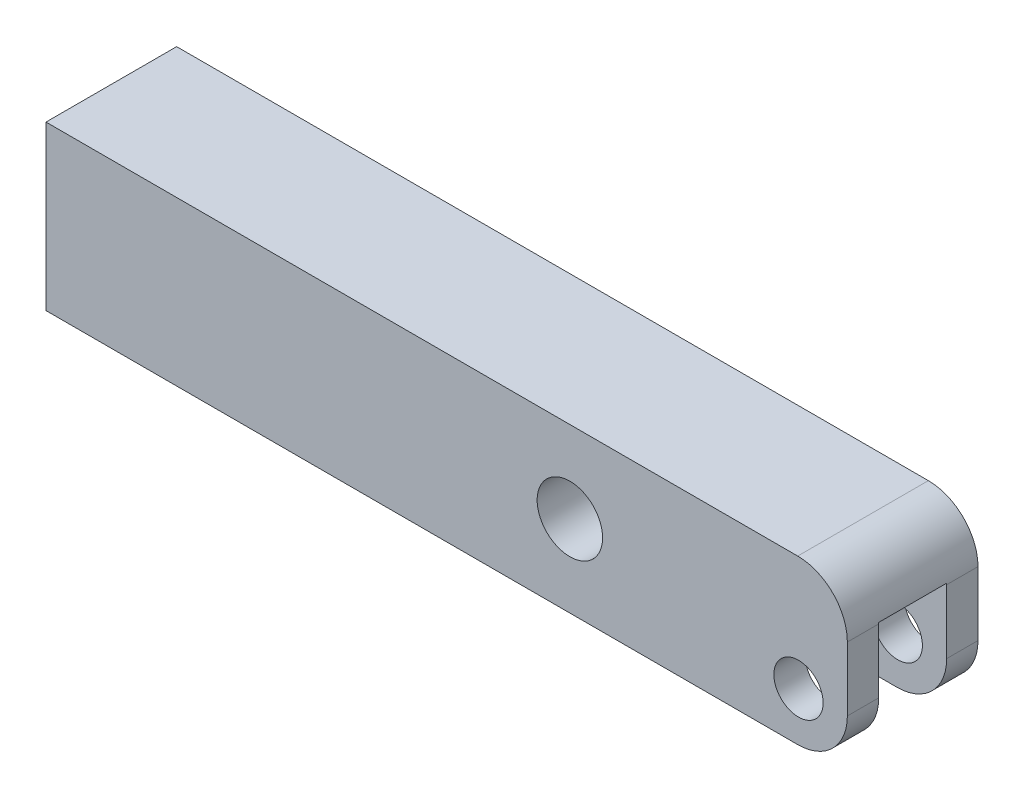
ISO-10303-21;
HEADER;
FILE_DESCRIPTION(('STEP AP214'),'2;1');
FILE_NAME('part.step','',(''),(''),'','','');
FILE_SCHEMA(('AUTOMOTIVE_DESIGN { 1 0 10303 214 1 1 1 1 }'));
ENDSEC;
DATA;
#1=APPLICATION_CONTEXT('core data for automotive mechanical design processes');
#2=APPLICATION_PROTOCOL_DEFINITION('international standard','automotive_design',2000,#1);
#3=PRODUCT_CONTEXT('',#1,'mechanical');
#4=PRODUCT('Part','Part','',(#3));
#5=PRODUCT_RELATED_PRODUCT_CATEGORY('part','',(#4));
#6=PRODUCT_DEFINITION_FORMATION('','',#4);
#7=PRODUCT_DEFINITION_CONTEXT('part definition',#1,'design');
#8=PRODUCT_DEFINITION('design','',#6,#7);
#9=PRODUCT_DEFINITION_SHAPE('','',#8);
#10=(LENGTH_UNIT() NAMED_UNIT(*) SI_UNIT(.MILLI.,.METRE.));
#11=(NAMED_UNIT(*) PLANE_ANGLE_UNIT() SI_UNIT($,.RADIAN.));
#12=(NAMED_UNIT(*) SI_UNIT($,.STERADIAN.) SOLID_ANGLE_UNIT());
#13=UNCERTAINTY_MEASURE_WITH_UNIT(LENGTH_MEASURE(1.E-05),#10,'distance_accuracy_value','');
#14=(GEOMETRIC_REPRESENTATION_CONTEXT(3) GLOBAL_UNCERTAINTY_ASSIGNED_CONTEXT((#13)) GLOBAL_UNIT_ASSIGNED_CONTEXT((#10,
#11,#12)) REPRESENTATION_CONTEXT('',''));
#15=CARTESIAN_POINT('',(0.,0.,0.));
#16=DIRECTION('',(0.,0.,1.));
#17=DIRECTION('',(1.,0.,0.));
#18=AXIS2_PLACEMENT_3D('',#15,#16,#17);
#19=CARTESIAN_POINT('',(4.7498,11.1252,6.35));
#20=DIRECTION('',(-1.,0.,0.));
#21=DIRECTION('',(0.,0.,1.));
#22=AXIS2_PLACEMENT_3D('',#19,#20,#21);
#23=PLANE('',#22);
#24=DIRECTION('',(0.,1.,0.));
#25=VECTOR('',#24,1.);
#26=CARTESIAN_POINT('',(4.7498,11.1252,-6.35));
#27=LINE('',#26,#25);
#28=CARTESIAN_POINT('',(4.7498,0.0762000000000002,-6.35));
#29=VERTEX_POINT('',#28);
#30=CARTESIAN_POINT('',(4.7498,6.2992,-6.35));
#31=VERTEX_POINT('',#30);
#32=EDGE_CURVE('E194',#29,#31,#27,.T.);
#33=ORIENTED_EDGE('',*,*,#32,.T.);
#34=DIRECTION('',(0.,0.,-1.));
#35=VECTOR('',#34,1.);
#36=CARTESIAN_POINT('',(4.7498,6.2992,6.35));
#37=LINE('',#36,#35);
#38=CARTESIAN_POINT('',(4.7498,6.2992,-3.302));
#39=VERTEX_POINT('',#38);
#40=EDGE_CURVE('E222',#31,#39,#37,.F.);
#41=ORIENTED_EDGE('',*,*,#40,.T.);
#42=DIRECTION('',(0.,-1.,0.));
#43=VECTOR('',#42,1.);
#44=CARTESIAN_POINT('',(4.7498,6.4262,-3.302));
#45=LINE('',#44,#43);
#46=CARTESIAN_POINT('',(4.7498,0.0762000000000002,-3.302));
#47=VERTEX_POINT('',#46);
#48=EDGE_CURVE('E133',#39,#47,#45,.T.);
#49=ORIENTED_EDGE('',*,*,#48,.T.);
#50=DIRECTION('',(0.,0.,-1.));
#51=VECTOR('',#50,1.);
#52=CARTESIAN_POINT('',(4.7498,0.0762000000000002,6.35));
#53=LINE('',#52,#51);
#54=EDGE_CURVE('E217',#47,#29,#53,.T.);
#55=ORIENTED_EDGE('',*,*,#54,.T.);
#56=EDGE_LOOP('',(#33,#41,#49,#55));
#57=FACE_BOUND('',#56,.T.);
#58=ADVANCED_FACE('F35',(#57),#23,.F.);
#59=CARTESIAN_POINT('',(0.,0.,6.35));
#60=DIRECTION('',(0.,0.,-1.));
#61=DIRECTION('',(-1.,0.,0.));
#62=AXIS2_PLACEMENT_3D('',#59,#60,#61);
#63=CYLINDRICAL_SURFACE('',#62,2.39395);
#64=CARTESIAN_POINT('',(0.,0.,3.302));
#65=DIRECTION('',(0.,0.,1.));
#66=DIRECTION('',(1.,0.,0.));
#67=AXIS2_PLACEMENT_3D('',#64,#65,#66);
#68=CIRCLE('',#67,2.39395);
#69=CARTESIAN_POINT('',(2.39395,0.,3.302));
#70=VERTEX_POINT('',#69);
#71=EDGE_CURVE('E170',#70,#70,#68,.T.);
#72=ORIENTED_EDGE('',*,*,#71,.F.);
#73=EDGE_LOOP('',(#72));
#74=FACE_BOUND('',#73,.T.);
#75=CARTESIAN_POINT('',(0.,0.,6.35));
#76=DIRECTION('',(0.,0.,1.));
#77=DIRECTION('',(1.,0.,0.));
#78=AXIS2_PLACEMENT_3D('',#75,#76,#77);
#79=CIRCLE('',#78,2.39395);
#80=CARTESIAN_POINT('',(2.39395,0.,6.35));
#81=VERTEX_POINT('',#80);
#82=EDGE_CURVE('E171',#81,#81,#79,.T.);
#83=ORIENTED_EDGE('',*,*,#82,.T.);
#84=EDGE_LOOP('',(#83));
#85=FACE_BOUND('',#84,.T.);
#86=ADVANCED_FACE('F287',(#74,#85),#63,.F.);
#87=CARTESIAN_POINT('',(-73.152,-4.7498,6.35));
#88=DIRECTION('',(0.,0.,1.));
#89=DIRECTION('',(1.,0.,0.));
#90=AXIS2_PLACEMENT_3D('',#87,#88,#89);
#91=PLANE('',#90);
#92=ORIENTED_EDGE('',*,*,#82,.F.);
#93=EDGE_LOOP('',(#92));
#94=FACE_BOUND('',#93,.T.);
#95=DIRECTION('',(0.,1.,0.));
#96=VECTOR('',#95,1.);
#97=CARTESIAN_POINT('',(4.7498,11.1252,6.35));
#98=LINE('',#97,#96);
#99=CARTESIAN_POINT('',(4.7498,0.0762000000000002,6.35));
#100=VERTEX_POINT('',#99);
#101=CARTESIAN_POINT('',(4.7498,6.2992,6.35));
#102=VERTEX_POINT('',#101);
#103=EDGE_CURVE('E183',#100,#102,#98,.T.);
#104=ORIENTED_EDGE('',*,*,#103,.T.);
#105=CARTESIAN_POINT('',(-0.0761999999999985,6.2992,6.35));
#106=DIRECTION('',(0.,0.,1.));
#107=DIRECTION('',(1.,0.,0.));
#108=AXIS2_PLACEMENT_3D('',#105,#106,#107);
#109=CIRCLE('',#108,4.826);
#110=CARTESIAN_POINT('',(-0.0761999999999985,11.1252,6.35));
#111=VERTEX_POINT('',#110);
#112=EDGE_CURVE('E234',#102,#111,#109,.T.);
#113=ORIENTED_EDGE('',*,*,#112,.T.);
#114=DIRECTION('',(-1.,0.,0.));
#115=VECTOR('',#114,1.);
#116=CARTESIAN_POINT('',(-73.152,11.1252,6.35));
#117=LINE('',#116,#115);
#118=CARTESIAN_POINT('',(-73.152,11.1252,6.35));
#119=VERTEX_POINT('',#118);
#120=EDGE_CURVE('E186',#111,#119,#117,.T.);
#121=ORIENTED_EDGE('',*,*,#120,.T.);
#122=DIRECTION('',(0.,-1.,0.));
#123=VECTOR('',#122,1.);
#124=CARTESIAN_POINT('',(-73.152,11.1252,6.35));
#125=LINE('',#124,#123);
#126=CARTESIAN_POINT('',(-73.152,-4.7498,6.35));
#127=VERTEX_POINT('',#126);
#128=EDGE_CURVE('E177',#119,#127,#125,.T.);
#129=ORIENTED_EDGE('',*,*,#128,.T.);
#130=DIRECTION('',(1.,0.,0.));
#131=VECTOR('',#130,1.);
#132=CARTESIAN_POINT('',(-73.152,-4.7498,6.35));
#133=LINE('',#132,#131);
#134=CARTESIAN_POINT('',(-0.0761999999999985,-4.7498,6.35));
#135=VERTEX_POINT('',#134);
#136=EDGE_CURVE('E180',#127,#135,#133,.T.);
#137=ORIENTED_EDGE('',*,*,#136,.T.);
#138=CARTESIAN_POINT('',(-0.0762000000000011,0.0762000000000002,6.35));
#139=DIRECTION('',(0.,0.,1.));
#140=DIRECTION('',(1.,0.,0.));
#141=AXIS2_PLACEMENT_3D('',#138,#139,#140);
#142=CIRCLE('',#141,4.826);
#143=EDGE_CURVE('E232',#135,#100,#142,.T.);
#144=ORIENTED_EDGE('',*,*,#143,.T.);
#145=EDGE_LOOP('',(#104,#113,#121,#129,#137,#144));
#146=FACE_BOUND('',#145,.T.);
#147=CARTESIAN_POINT('',(-22.225,3.175,6.35));
#148=DIRECTION('',(0.,0.,1.));
#149=DIRECTION('',(1.,0.,0.));
#150=AXIS2_PLACEMENT_3D('',#147,#148,#149);
#151=CIRCLE('',#150,3.18135);
#152=CARTESIAN_POINT('',(-19.04365,3.175,6.35));
#153=VERTEX_POINT('',#152);
#154=EDGE_CURVE('E163',#153,#153,#151,.T.);
#155=ORIENTED_EDGE('',*,*,#154,.F.);
#156=EDGE_LOOP('',(#155));
#157=FACE_BOUND('',#156,.T.);
#158=ADVANCED_FACE('F238',(#94,#146,#157),#91,.T.);
#159=CARTESIAN_POINT('',(-73.152,-4.7498,-6.35));
#160=DIRECTION('',(0.,0.,1.));
#161=DIRECTION('',(1.,0.,0.));
#162=AXIS2_PLACEMENT_3D('',#159,#160,#161);
#163=PLANE('',#162);
#164=CARTESIAN_POINT('',(0.,0.,-6.35));
#165=DIRECTION('',(0.,0.,1.));
#166=DIRECTION('',(1.,0.,0.));
#167=AXIS2_PLACEMENT_3D('',#164,#165,#166);
#168=CIRCLE('',#167,2.39395);
#169=CARTESIAN_POINT('',(2.39395,0.,-6.35));
#170=VERTEX_POINT('',#169);
#171=EDGE_CURVE('E166',#170,#170,#168,.T.);
#172=ORIENTED_EDGE('',*,*,#171,.T.);
#173=EDGE_LOOP('',(#172));
#174=FACE_BOUND('',#173,.T.);
#175=DIRECTION('',(-1.,0.,0.));
#176=VECTOR('',#175,1.);
#177=CARTESIAN_POINT('',(-73.152,11.1252,-6.35));
#178=LINE('',#177,#176);
#179=CARTESIAN_POINT('',(-0.0761999999999985,11.1252,-6.35));
#180=VERTEX_POINT('',#179);
#181=CARTESIAN_POINT('',(-73.152,11.1252,-6.35));
#182=VERTEX_POINT('',#181);
#183=EDGE_CURVE('E181',#180,#182,#178,.T.);
#184=ORIENTED_EDGE('',*,*,#183,.F.);
#185=CARTESIAN_POINT('',(-0.0761999999999985,6.2992,-6.35));
#186=DIRECTION('',(0.,0.,1.));
#187=DIRECTION('',(1.,0.,0.));
#188=AXIS2_PLACEMENT_3D('',#185,#186,#187);
#189=CIRCLE('',#188,4.826);
#190=EDGE_CURVE('E212',#180,#31,#189,.F.);
#191=ORIENTED_EDGE('',*,*,#190,.T.);
#192=ORIENTED_EDGE('',*,*,#32,.F.);
#193=CARTESIAN_POINT('',(-0.0762000000000011,0.0762000000000002,-6.35));
#194=DIRECTION('',(0.,0.,1.));
#195=DIRECTION('',(1.,0.,0.));
#196=AXIS2_PLACEMENT_3D('',#193,#194,#195);
#197=CIRCLE('',#196,4.826);
#198=CARTESIAN_POINT('',(-0.0761999999999985,-4.7498,-6.35));
#199=VERTEX_POINT('',#198);
#200=EDGE_CURVE('E210',#29,#199,#197,.F.);
#201=ORIENTED_EDGE('',*,*,#200,.T.);
#202=DIRECTION('',(1.,0.,0.));
#203=VECTOR('',#202,1.);
#204=CARTESIAN_POINT('',(-73.152,-4.7498,-6.35));
#205=LINE('',#204,#203);
#206=CARTESIAN_POINT('',(-73.152,-4.7498,-6.35));
#207=VERTEX_POINT('',#206);
#208=EDGE_CURVE('E191',#207,#199,#205,.T.);
#209=ORIENTED_EDGE('',*,*,#208,.F.);
#210=DIRECTION('',(0.,-1.,0.));
#211=VECTOR('',#210,1.);
#212=CARTESIAN_POINT('',(-73.152,11.1252,-6.35));
#213=LINE('',#212,#211);
#214=EDGE_CURVE('E174',#182,#207,#213,.T.);
#215=ORIENTED_EDGE('',*,*,#214,.F.);
#216=EDGE_LOOP('',(#184,#191,#192,#201,#209,#215));
#217=FACE_BOUND('',#216,.T.);
#218=CARTESIAN_POINT('',(-22.225,3.175,-6.35));
#219=DIRECTION('',(0.,0.,1.));
#220=DIRECTION('',(1.,0.,0.));
#221=AXIS2_PLACEMENT_3D('',#218,#219,#220);
#222=CIRCLE('',#221,3.18135);
#223=CARTESIAN_POINT('',(-19.04365,3.175,-6.35));
#224=VERTEX_POINT('',#223);
#225=EDGE_CURVE('E167',#224,#224,#222,.T.);
#226=ORIENTED_EDGE('',*,*,#225,.T.);
#227=EDGE_LOOP('',(#226));
#228=FACE_BOUND('',#227,.T.);
#229=ADVANCED_FACE('F253',(#174,#217,#228),#163,.F.);
#230=CARTESIAN_POINT('',(-73.152,11.1252,6.35));
#231=DIRECTION('',(1.,0.,0.));
#232=DIRECTION('',(0.,0.,-1.));
#233=AXIS2_PLACEMENT_3D('',#230,#231,#232);
#234=PLANE('',#233);
#235=ORIENTED_EDGE('',*,*,#214,.T.);
#236=DIRECTION('',(0.,0.,-1.));
#237=VECTOR('',#236,1.);
#238=CARTESIAN_POINT('',(-73.152,-4.7498,6.35));
#239=LINE('',#238,#237);
#240=EDGE_CURVE('E200',#127,#207,#239,.T.);
#241=ORIENTED_EDGE('',*,*,#240,.F.);
#242=ORIENTED_EDGE('',*,*,#128,.F.);
#243=DIRECTION('',(0.,0.,-1.));
#244=VECTOR('',#243,1.);
#245=CARTESIAN_POINT('',(-73.152,11.1252,6.35));
#246=LINE('',#245,#244);
#247=EDGE_CURVE('E188',#119,#182,#246,.T.);
#248=ORIENTED_EDGE('',*,*,#247,.T.);
#249=EDGE_LOOP('',(#235,#241,#242,#248));
#250=FACE_BOUND('',#249,.T.);
#251=ADVANCED_FACE('F265',(#250),#234,.F.);
#252=CARTESIAN_POINT('',(-73.152,-4.7498,6.35));
#253=DIRECTION('',(0.,1.,0.));
#254=DIRECTION('',(0.,0.,1.));
#255=AXIS2_PLACEMENT_3D('',#252,#253,#254);
#256=PLANE('',#255);
#257=ORIENTED_EDGE('',*,*,#208,.T.);
#258=DIRECTION('',(0.,0.,-1.));
#259=VECTOR('',#258,1.);
#260=CARTESIAN_POINT('',(-0.0761999999999985,-4.7498,6.35));
#261=LINE('',#260,#259);
#262=CARTESIAN_POINT('',(-0.0762000000000011,-4.7498,-3.302));
#263=VERTEX_POINT('',#262);
#264=EDGE_CURVE('E11',#199,#263,#261,.F.);
#265=ORIENTED_EDGE('',*,*,#264,.T.);
#266=DIRECTION('',(1.,0.,0.));
#267=VECTOR('',#266,1.);
#268=CARTESIAN_POINT('',(-6.4262,-4.7498,-3.302));
#269=LINE('',#268,#267);
#270=CARTESIAN_POINT('',(-6.4262,-4.7498,-3.302));
#271=VERTEX_POINT('',#270);
#272=EDGE_CURVE('E150',#271,#263,#269,.T.);
#273=ORIENTED_EDGE('',*,*,#272,.F.);
#274=CARTESIAN_POINT('',(-6.4262,-4.7498,0.));
#275=DIRECTION('',(0.,-1.,0.));
#276=DIRECTION('',(0.,0.,-1.));
#277=AXIS2_PLACEMENT_3D('',#274,#275,#276);
#278=CIRCLE('',#277,3.302);
#279=CARTESIAN_POINT('',(-6.4262,-4.7498,3.302));
#280=VERTEX_POINT('',#279);
#281=EDGE_CURVE('E129',#280,#271,#278,.T.);
#282=ORIENTED_EDGE('',*,*,#281,.F.);
#283=DIRECTION('',(-1.,0.,0.));
#284=VECTOR('',#283,1.);
#285=CARTESIAN_POINT('',(-6.4262,-4.7498,3.302));
#286=LINE('',#285,#284);
#287=CARTESIAN_POINT('',(-0.0762000000000011,-4.7498,3.302));
#288=VERTEX_POINT('',#287);
#289=EDGE_CURVE('E148',#288,#280,#286,.T.);
#290=ORIENTED_EDGE('',*,*,#289,.F.);
#291=DIRECTION('',(0.,0.,-1.));
#292=VECTOR('',#291,1.);
#293=CARTESIAN_POINT('',(-0.0761999999999985,-4.7498,6.35));
#294=LINE('',#293,#292);
#295=EDGE_CURVE('E43',#288,#135,#294,.F.);
#296=ORIENTED_EDGE('',*,*,#295,.T.);
#297=ORIENTED_EDGE('',*,*,#136,.F.);
#298=ORIENTED_EDGE('',*,*,#240,.T.);
#299=EDGE_LOOP('',(#257,#265,#273,#282,#290,#296,#297,#298));
#300=FACE_BOUND('',#299,.T.);
#301=ADVANCED_FACE('F262',(#300),#256,.F.);
#302=DIRECTION('',(0.,-1.,0.));
#303=VECTOR('',#302,1.);
#304=CARTESIAN_POINT('',(4.7498,6.4262,3.302));
#305=LINE('',#304,#303);
#306=CARTESIAN_POINT('',(4.7498,6.2992,3.302));
#307=VERTEX_POINT('',#306);
#308=CARTESIAN_POINT('',(4.7498,0.0762000000000002,3.302));
#309=VERTEX_POINT('',#308);
#310=EDGE_CURVE('E159',#307,#309,#305,.T.);
#311=ORIENTED_EDGE('',*,*,#310,.F.);
#312=DIRECTION('',(0.,0.,-1.));
#313=VECTOR('',#312,1.);
#314=CARTESIAN_POINT('',(4.7498,6.2992,6.35));
#315=LINE('',#314,#313);
#316=EDGE_CURVE('E220',#307,#102,#315,.F.);
#317=ORIENTED_EDGE('',*,*,#316,.T.);
#318=ORIENTED_EDGE('',*,*,#103,.F.);
#319=DIRECTION('',(0.,0.,-1.));
#320=VECTOR('',#319,1.);
#321=CARTESIAN_POINT('',(4.7498,0.0762000000000002,6.35));
#322=LINE('',#321,#320);
#323=EDGE_CURVE('E214',#100,#309,#322,.T.);
#324=ORIENTED_EDGE('',*,*,#323,.T.);
#325=EDGE_LOOP('',(#311,#317,#318,#324));
#326=FACE_BOUND('',#325,.T.);
#327=ADVANCED_FACE('F271',(#326),#23,.F.);
#328=CARTESIAN_POINT('',(-73.152,11.1252,6.35));
#329=DIRECTION('',(0.,-1.,0.));
#330=DIRECTION('',(0.,0.,-1.));
#331=AXIS2_PLACEMENT_3D('',#328,#329,#330);
#332=PLANE('',#331);
#333=ORIENTED_EDGE('',*,*,#120,.F.);
#334=DIRECTION('',(0.,0.,-1.));
#335=VECTOR('',#334,1.);
#336=CARTESIAN_POINT('',(-0.0761999999999985,11.1252,6.35));
#337=LINE('',#336,#335);
#338=EDGE_CURVE('E203',#111,#180,#337,.T.);
#339=ORIENTED_EDGE('',*,*,#338,.T.);
#340=ORIENTED_EDGE('',*,*,#183,.T.);
#341=ORIENTED_EDGE('',*,*,#247,.F.);
#342=EDGE_LOOP('',(#333,#339,#340,#341));
#343=FACE_BOUND('',#342,.T.);
#344=ADVANCED_FACE('F246',(#343),#332,.F.);
#345=CARTESIAN_POINT('',(0.,0.,-3.302));
#346=DIRECTION('',(0.,0.,-1.));
#347=DIRECTION('',(-1.,0.,0.));
#348=AXIS2_PLACEMENT_3D('',#345,#346,#347);
#349=CIRCLE('',#348,2.39395);
#350=CARTESIAN_POINT('',(-2.39395,0.,-3.302));
#351=VERTEX_POINT('',#350);
#352=EDGE_CURVE('E158',#351,#351,#349,.T.);
#353=ORIENTED_EDGE('',*,*,#352,.F.);
#354=EDGE_LOOP('',(#353));
#355=FACE_BOUND('',#354,.T.);
#356=ORIENTED_EDGE('',*,*,#171,.F.);
#357=EDGE_LOOP('',(#356));
#358=FACE_BOUND('',#357,.T.);
#359=ADVANCED_FACE('F294',(#355,#358),#63,.F.);
#360=CARTESIAN_POINT('',(-22.225,3.175,6.35));
#361=DIRECTION('',(0.,0.,-1.));
#362=DIRECTION('',(-1.,0.,0.));
#363=AXIS2_PLACEMENT_3D('',#360,#361,#362);
#364=CYLINDRICAL_SURFACE('',#363,3.18135);
#365=ORIENTED_EDGE('',*,*,#154,.T.);
#366=EDGE_LOOP('',(#365));
#367=FACE_BOUND('',#366,.T.);
#368=ORIENTED_EDGE('',*,*,#225,.F.);
#369=EDGE_LOOP('',(#368));
#370=FACE_BOUND('',#369,.T.);
#371=ADVANCED_FACE('F283',(#367,#370),#364,.F.);
#372=CARTESIAN_POINT('',(-6.4262,6.4262,0.));
#373=DIRECTION('',(0.,-1.,0.));
#374=DIRECTION('',(0.,0.,-1.));
#375=AXIS2_PLACEMENT_3D('',#372,#373,#374);
#376=CYLINDRICAL_SURFACE('',#375,3.302);
#377=ORIENTED_EDGE('',*,*,#281,.T.);
#378=DIRECTION('',(0.,-1.,0.));
#379=VECTOR('',#378,1.);
#380=CARTESIAN_POINT('',(-6.4262,6.4262,-3.302));
#381=LINE('',#380,#379);
#382=CARTESIAN_POINT('',(-6.4262,6.4262,-3.302));
#383=VERTEX_POINT('',#382);
#384=EDGE_CURVE('E122',#383,#271,#381,.T.);
#385=ORIENTED_EDGE('',*,*,#384,.F.);
#386=CARTESIAN_POINT('',(-6.4262,6.4262,0.));
#387=DIRECTION('',(0.,-1.,0.));
#388=DIRECTION('',(0.,0.,-1.));
#389=AXIS2_PLACEMENT_3D('',#386,#387,#388);
#390=CIRCLE('',#389,3.302);
#391=CARTESIAN_POINT('',(-6.4262,6.4262,3.302));
#392=VERTEX_POINT('',#391);
#393=EDGE_CURVE('E127',#392,#383,#390,.T.);
#394=ORIENTED_EDGE('',*,*,#393,.F.);
#395=DIRECTION('',(0.,-1.,0.));
#396=VECTOR('',#395,1.);
#397=CARTESIAN_POINT('',(-6.4262,6.4262,3.302));
#398=LINE('',#397,#396);
#399=EDGE_CURVE('E156',#392,#280,#398,.T.);
#400=ORIENTED_EDGE('',*,*,#399,.T.);
#401=EDGE_LOOP('',(#377,#385,#394,#400));
#402=FACE_BOUND('',#401,.T.);
#403=ADVANCED_FACE('F124',(#402),#376,.F.);
#404=CARTESIAN_POINT('',(-6.4262,6.4262,3.302));
#405=DIRECTION('',(0.,0.,1.));
#406=DIRECTION('',(1.,0.,0.));
#407=AXIS2_PLACEMENT_3D('',#404,#405,#406);
#408=PLANE('',#407);
#409=ORIENTED_EDGE('',*,*,#71,.T.);
#410=EDGE_LOOP('',(#409));
#411=FACE_BOUND('',#410,.T.);
#412=DIRECTION('',(-1.,0.,0.));
#413=VECTOR('',#412,1.);
#414=CARTESIAN_POINT('',(-6.4262,6.4262,3.302));
#415=LINE('',#414,#413);
#416=CARTESIAN_POINT('',(4.74812865795854,6.4262,3.302));
#417=VERTEX_POINT('',#416);
#418=EDGE_CURVE('E134',#417,#392,#415,.T.);
#419=ORIENTED_EDGE('',*,*,#418,.F.);
#420=CARTESIAN_POINT('',(-0.0761999999999985,6.2992,3.302));
#421=DIRECTION('',(0.,0.,1.));
#422=DIRECTION('',(1.,0.,0.));
#423=AXIS2_PLACEMENT_3D('',#420,#421,#422);
#424=CIRCLE('',#423,4.826);
#425=EDGE_CURVE('E230',#417,#307,#424,.F.);
#426=ORIENTED_EDGE('',*,*,#425,.T.);
#427=ORIENTED_EDGE('',*,*,#310,.T.);
#428=CARTESIAN_POINT('',(-0.0762000000000011,0.0762000000000002,3.302));
#429=DIRECTION('',(0.,0.,1.));
#430=DIRECTION('',(1.,0.,0.));
#431=AXIS2_PLACEMENT_3D('',#428,#429,#430);
#432=CIRCLE('',#431,4.826);
#433=EDGE_CURVE('E57',#309,#288,#432,.F.);
#434=ORIENTED_EDGE('',*,*,#433,.T.);
#435=ORIENTED_EDGE('',*,*,#289,.T.);
#436=ORIENTED_EDGE('',*,*,#399,.F.);
#437=EDGE_LOOP('',(#419,#426,#427,#434,#435,#436));
#438=FACE_BOUND('',#437,.T.);
#439=ADVANCED_FACE('F272',(#411,#438),#408,.F.);
#440=CARTESIAN_POINT('',(-6.4262,6.4262,-3.302));
#441=DIRECTION('',(0.,0.,-1.));
#442=DIRECTION('',(-1.,0.,0.));
#443=AXIS2_PLACEMENT_3D('',#440,#441,#442);
#444=PLANE('',#443);
#445=ORIENTED_EDGE('',*,*,#352,.T.);
#446=EDGE_LOOP('',(#445));
#447=FACE_BOUND('',#446,.T.);
#448=ORIENTED_EDGE('',*,*,#48,.F.);
#449=CARTESIAN_POINT('',(-0.0761999999999985,6.2992,-3.302));
#450=DIRECTION('',(0.,0.,-1.));
#451=DIRECTION('',(-1.,0.,0.));
#452=AXIS2_PLACEMENT_3D('',#449,#450,#451);
#453=CIRCLE('',#452,4.826);
#454=CARTESIAN_POINT('',(4.74812865795854,6.4262,-3.302));
#455=VERTEX_POINT('',#454);
#456=EDGE_CURVE('E141',#39,#455,#453,.F.);
#457=ORIENTED_EDGE('',*,*,#456,.T.);
#458=DIRECTION('',(1.,0.,0.));
#459=VECTOR('',#458,1.);
#460=CARTESIAN_POINT('',(-6.4262,6.4262,-3.302));
#461=LINE('',#460,#459);
#462=EDGE_CURVE('E137',#383,#455,#461,.T.);
#463=ORIENTED_EDGE('',*,*,#462,.F.);
#464=ORIENTED_EDGE('',*,*,#384,.T.);
#465=ORIENTED_EDGE('',*,*,#272,.T.);
#466=CARTESIAN_POINT('',(-0.0762000000000011,0.0762000000000002,-3.302));
#467=DIRECTION('',(0.,0.,-1.));
#468=DIRECTION('',(-1.,0.,0.));
#469=AXIS2_PLACEMENT_3D('',#466,#467,#468);
#470=CIRCLE('',#469,4.826);
#471=EDGE_CURVE('E224',#263,#47,#470,.F.);
#472=ORIENTED_EDGE('',*,*,#471,.T.);
#473=EDGE_LOOP('',(#448,#457,#463,#464,#465,#472));
#474=FACE_BOUND('',#473,.T.);
#475=ADVANCED_FACE('F139',(#447,#474),#444,.F.);
#476=CARTESIAN_POINT('',(-6.4262,6.4262,0.));
#477=DIRECTION('',(0.,-1.,0.));
#478=DIRECTION('',(0.,0.,-1.));
#479=AXIS2_PLACEMENT_3D('',#476,#477,#478);
#480=PLANE('',#479);
#481=ORIENTED_EDGE('',*,*,#462,.T.);
#482=DIRECTION('',(0.,0.,-1.));
#483=VECTOR('',#482,1.);
#484=CARTESIAN_POINT('',(4.74812865795854,6.4262,-3.302));
#485=LINE('',#484,#483);
#486=EDGE_CURVE('E227',#455,#417,#485,.F.);
#487=ORIENTED_EDGE('',*,*,#486,.T.);
#488=ORIENTED_EDGE('',*,*,#418,.T.);
#489=ORIENTED_EDGE('',*,*,#393,.T.);
#490=EDGE_LOOP('',(#481,#487,#488,#489));
#491=FACE_BOUND('',#490,.T.);
#492=ADVANCED_FACE('F145',(#491),#480,.T.);
#493=CARTESIAN_POINT('',(-0.0761999999999985,6.2992,6.35));
#494=DIRECTION('',(0.,0.,-1.));
#495=DIRECTION('',(-1.,0.,0.));
#496=AXIS2_PLACEMENT_3D('',#493,#494,#495);
#497=CYLINDRICAL_SURFACE('',#496,4.826);
#498=ORIENTED_EDGE('',*,*,#456,.F.);
#499=ORIENTED_EDGE('',*,*,#40,.F.);
#500=ORIENTED_EDGE('',*,*,#190,.F.);
#501=ORIENTED_EDGE('',*,*,#338,.F.);
#502=ORIENTED_EDGE('',*,*,#112,.F.);
#503=ORIENTED_EDGE('',*,*,#316,.F.);
#504=ORIENTED_EDGE('',*,*,#425,.F.);
#505=ORIENTED_EDGE('',*,*,#486,.F.);
#506=EDGE_LOOP('',(#498,#499,#500,#501,#502,#503,#504,#505));
#507=FACE_BOUND('',#506,.T.);
#508=ADVANCED_FACE('F249',(#507),#497,.T.);
#509=CARTESIAN_POINT('',(-0.0762000000000011,0.0762000000000002,6.35));
#510=DIRECTION('',(0.,0.,-1.));
#511=DIRECTION('',(-1.,0.,0.));
#512=AXIS2_PLACEMENT_3D('',#509,#510,#511);
#513=CYLINDRICAL_SURFACE('',#512,4.826);
#514=ORIENTED_EDGE('',*,*,#471,.F.);
#515=ORIENTED_EDGE('',*,*,#264,.F.);
#516=ORIENTED_EDGE('',*,*,#200,.F.);
#517=ORIENTED_EDGE('',*,*,#54,.F.);
#518=EDGE_LOOP('',(#514,#515,#516,#517));
#519=FACE_BOUND('',#518,.T.);
#520=ADVANCED_FACE('F260',(#519),#513,.T.);
#521=CARTESIAN_POINT('',(-0.0762000000000011,0.0762000000000002,6.35));
#522=DIRECTION('',(0.,0.,-1.));
#523=DIRECTION('',(-1.,0.,0.));
#524=AXIS2_PLACEMENT_3D('',#521,#522,#523);
#525=CYLINDRICAL_SURFACE('',#524,4.826);
#526=ORIENTED_EDGE('',*,*,#143,.F.);
#527=ORIENTED_EDGE('',*,*,#295,.F.);
#528=ORIENTED_EDGE('',*,*,#433,.F.);
#529=ORIENTED_EDGE('',*,*,#323,.F.);
#530=EDGE_LOOP('',(#526,#527,#528,#529));
#531=FACE_BOUND('',#530,.T.);
#532=ADVANCED_FACE('F37',(#531),#525,.T.);
#533=CLOSED_SHELL('',(#58,#86,#158,#229,#251,#301,#327,#344,#359,#371,#403,#439,#475,#492,#508,
#520,#532));
#534=MANIFOLD_SOLID_BREP('B2',#533);
#535=ADVANCED_BREP_SHAPE_REPRESENTATION('',(#18,#534),#14);
#536=SHAPE_DEFINITION_REPRESENTATION(#9,#535);
ENDSEC;
END-ISO-10303-21;
